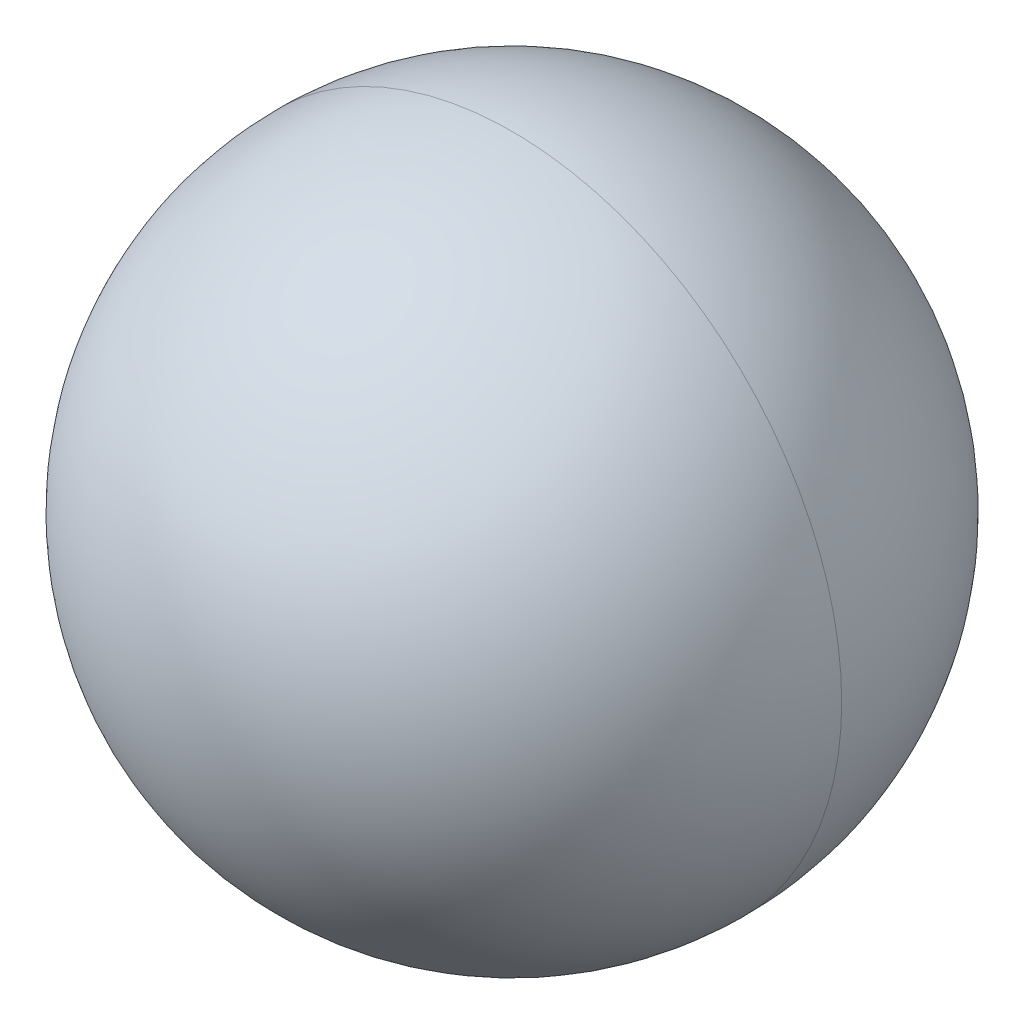
ISO-10303-21;
HEADER;
FILE_DESCRIPTION(('STEP AP214'),'2;1');
FILE_NAME('part.step','',(''),(''),'','','');
FILE_SCHEMA(('AUTOMOTIVE_DESIGN { 1 0 10303 214 1 1 1 1 }'));
ENDSEC;
DATA;
#1=APPLICATION_CONTEXT('core data for automotive mechanical design processes');
#2=APPLICATION_PROTOCOL_DEFINITION('international standard','automotive_design',2000,#1);
#3=PRODUCT_CONTEXT('',#1,'mechanical');
#4=PRODUCT('Part','Part','',(#3));
#5=PRODUCT_RELATED_PRODUCT_CATEGORY('part','',(#4));
#6=PRODUCT_DEFINITION_FORMATION('','',#4);
#7=PRODUCT_DEFINITION_CONTEXT('part definition',#1,'design');
#8=PRODUCT_DEFINITION('design','',#6,#7);
#9=PRODUCT_DEFINITION_SHAPE('','',#8);
#10=(LENGTH_UNIT() NAMED_UNIT(*) SI_UNIT(.MILLI.,.METRE.));
#11=(NAMED_UNIT(*) PLANE_ANGLE_UNIT() SI_UNIT($,.RADIAN.));
#12=(NAMED_UNIT(*) SI_UNIT($,.STERADIAN.) SOLID_ANGLE_UNIT());
#13=UNCERTAINTY_MEASURE_WITH_UNIT(LENGTH_MEASURE(1.E-05),#10,'distance_accuracy_value','');
#14=(GEOMETRIC_REPRESENTATION_CONTEXT(3) GLOBAL_UNCERTAINTY_ASSIGNED_CONTEXT((#13)) GLOBAL_UNIT_ASSIGNED_CONTEXT((#10,
#11,#12)) REPRESENTATION_CONTEXT('',''));
#15=CARTESIAN_POINT('',(0.,0.,0.));
#16=DIRECTION('',(0.,0.,1.));
#17=DIRECTION('',(1.,0.,0.));
#18=AXIS2_PLACEMENT_3D('',#15,#16,#17);
#19=CARTESIAN_POINT('',(2.,14.25,0.));
#20=DIRECTION('',(1.,0.,0.));
#21=DIRECTION('',(0.,0.,-1.));
#22=AXIS2_PLACEMENT_3D('',#19,#20,#21);
#23=SPHERICAL_SURFACE('',#22,0.794);
#24=CARTESIAN_POINT('',(2.,14.25,0.));
#25=DIRECTION('',(0.,0.,1.));
#26=DIRECTION('',(1.,0.,0.));
#27=AXIS2_PLACEMENT_3D('',#24,#25,#26);
#28=CIRCLE('',#27,0.794);
#29=CARTESIAN_POINT('',(2.794,14.25,0.));
#30=VERTEX_POINT('',#29);
#31=CARTESIAN_POINT('',(1.206,14.25,0.));
#32=VERTEX_POINT('',#31);
#33=EDGE_CURVE('E11',#30,#32,#28,.T.);
#34=ORIENTED_EDGE('',*,*,#33,.T.);
#35=CARTESIAN_POINT('',(2.,14.25,0.));
#36=DIRECTION('',(0.,0.,-1.));
#37=DIRECTION('',(1.,0.,0.));
#38=AXIS2_PLACEMENT_3D('',#35,#36,#37);
#39=CIRCLE('',#38,0.794);
#40=EDGE_CURVE('E24',#30,#32,#39,.T.);
#41=ORIENTED_EDGE('',*,*,#40,.F.);
#42=EDGE_LOOP('',(#34,#41));
#43=FACE_BOUND('',#42,.T.);
#44=ADVANCED_FACE('F16',(#43),#23,.T.);
#45=CARTESIAN_POINT('',(2.,14.25,0.));
#46=DIRECTION('',(1.,0.,0.));
#47=DIRECTION('',(0.,0.,1.));
#48=AXIS2_PLACEMENT_3D('',#45,#46,#47);
#49=SPHERICAL_SURFACE('',#48,0.794);
#50=ORIENTED_EDGE('',*,*,#33,.F.);
#51=ORIENTED_EDGE('',*,*,#40,.T.);
#52=EDGE_LOOP('',(#50,#51));
#53=FACE_BOUND('',#52,.T.);
#54=ADVANCED_FACE('F32',(#53),#49,.T.);
#55=CLOSED_SHELL('',(#44,#54));
#56=MANIFOLD_SOLID_BREP('B1',#55);
#57=ADVANCED_BREP_SHAPE_REPRESENTATION('',(#18,#56),#14);
#58=SHAPE_DEFINITION_REPRESENTATION(#9,#57);
ENDSEC;
END-ISO-10303-21;
